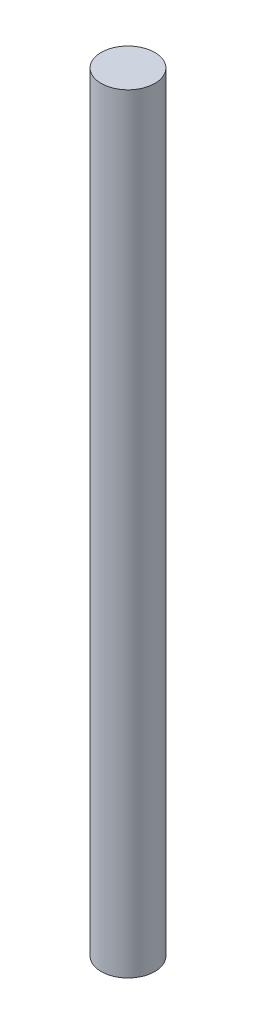
ISO-10303-21;
HEADER;
FILE_DESCRIPTION(('STEP AP214'),'2;1');
FILE_NAME('part.step','',(''),(''),'','','');
FILE_SCHEMA(('AUTOMOTIVE_DESIGN { 1 0 10303 214 1 1 1 1 }'));
ENDSEC;
DATA;
#1=APPLICATION_CONTEXT('core data for automotive mechanical design processes');
#2=APPLICATION_PROTOCOL_DEFINITION('international standard','automotive_design',2000,#1);
#3=PRODUCT_CONTEXT('',#1,'mechanical');
#4=PRODUCT('Part','Part','',(#3));
#5=PRODUCT_RELATED_PRODUCT_CATEGORY('part','',(#4));
#6=PRODUCT_DEFINITION_FORMATION('','',#4);
#7=PRODUCT_DEFINITION_CONTEXT('part definition',#1,'design');
#8=PRODUCT_DEFINITION('design','',#6,#7);
#9=PRODUCT_DEFINITION_SHAPE('','',#8);
#10=(LENGTH_UNIT() NAMED_UNIT(*) SI_UNIT(.MILLI.,.METRE.));
#11=(NAMED_UNIT(*) PLANE_ANGLE_UNIT() SI_UNIT($,.RADIAN.));
#12=(NAMED_UNIT(*) SI_UNIT($,.STERADIAN.) SOLID_ANGLE_UNIT());
#13=UNCERTAINTY_MEASURE_WITH_UNIT(LENGTH_MEASURE(1.E-05),#10,'distance_accuracy_value','');
#14=(GEOMETRIC_REPRESENTATION_CONTEXT(3) GLOBAL_UNCERTAINTY_ASSIGNED_CONTEXT((#13)) GLOBAL_UNIT_ASSIGNED_CONTEXT((#10,
#11,#12)) REPRESENTATION_CONTEXT('',''));
#15=CARTESIAN_POINT('',(0.,0.,0.));
#16=DIRECTION('',(0.,0.,1.));
#17=DIRECTION('',(1.,0.,0.));
#18=AXIS2_PLACEMENT_3D('',#15,#16,#17);
#19=CARTESIAN_POINT('',(0.,21.5,0.));
#20=DIRECTION('',(0.,-1.,0.));
#21=DIRECTION('',(0.,0.,-1.));
#22=AXIS2_PLACEMENT_3D('',#19,#20,#21);
#23=CYLINDRICAL_SURFACE('',#22,0.750000000000001);
#24=CARTESIAN_POINT('',(0.,21.5,0.));
#25=DIRECTION('',(0.,1.,0.));
#26=DIRECTION('',(0.,0.,1.));
#27=AXIS2_PLACEMENT_3D('',#24,#25,#26);
#28=CIRCLE('',#27,0.750000000000001);
#29=CARTESIAN_POINT('',(0.,21.5,0.750000000000001));
#30=VERTEX_POINT('',#29);
#31=EDGE_CURVE('E10',#30,#30,#28,.T.);
#32=ORIENTED_EDGE('',*,*,#31,.F.);
#33=EDGE_LOOP('',(#32));
#34=FACE_BOUND('',#33,.T.);
#35=CARTESIAN_POINT('',(0.,0.,0.));
#36=DIRECTION('',(0.,1.,0.));
#37=DIRECTION('',(0.,0.,1.));
#38=AXIS2_PLACEMENT_3D('',#35,#36,#37);
#39=CIRCLE('',#38,0.750000000000001);
#40=CARTESIAN_POINT('',(0.,0.,0.750000000000001));
#41=VERTEX_POINT('',#40);
#42=EDGE_CURVE('E34',#41,#41,#39,.T.);
#43=ORIENTED_EDGE('',*,*,#42,.T.);
#44=EDGE_LOOP('',(#43));
#45=FACE_BOUND('',#44,.T.);
#46=ADVANCED_FACE('F31',(#34,#45),#23,.T.);
#47=CARTESIAN_POINT('',(0.,21.5,0.));
#48=DIRECTION('',(0.,1.,0.));
#49=DIRECTION('',(0.,0.,1.));
#50=AXIS2_PLACEMENT_3D('',#47,#48,#49);
#51=PLANE('',#50);
#52=ORIENTED_EDGE('',*,*,#31,.T.);
#53=EDGE_LOOP('',(#52));
#54=FACE_BOUND('',#53,.T.);
#55=ADVANCED_FACE('F46',(#54),#51,.T.);
#56=CARTESIAN_POINT('',(0.,0.,0.));
#57=DIRECTION('',(0.,1.,0.));
#58=DIRECTION('',(0.,0.,1.));
#59=AXIS2_PLACEMENT_3D('',#56,#57,#58);
#60=PLANE('',#59);
#61=ORIENTED_EDGE('',*,*,#42,.F.);
#62=EDGE_LOOP('',(#61));
#63=FACE_BOUND('',#62,.T.);
#64=ADVANCED_FACE('F44',(#63),#60,.F.);
#65=CLOSED_SHELL('',(#46,#55,#64));
#66=MANIFOLD_SOLID_BREP('B2',#65);
#67=ADVANCED_BREP_SHAPE_REPRESENTATION('',(#18,#66),#14);
#68=SHAPE_DEFINITION_REPRESENTATION(#9,#67);
ENDSEC;
END-ISO-10303-21;
